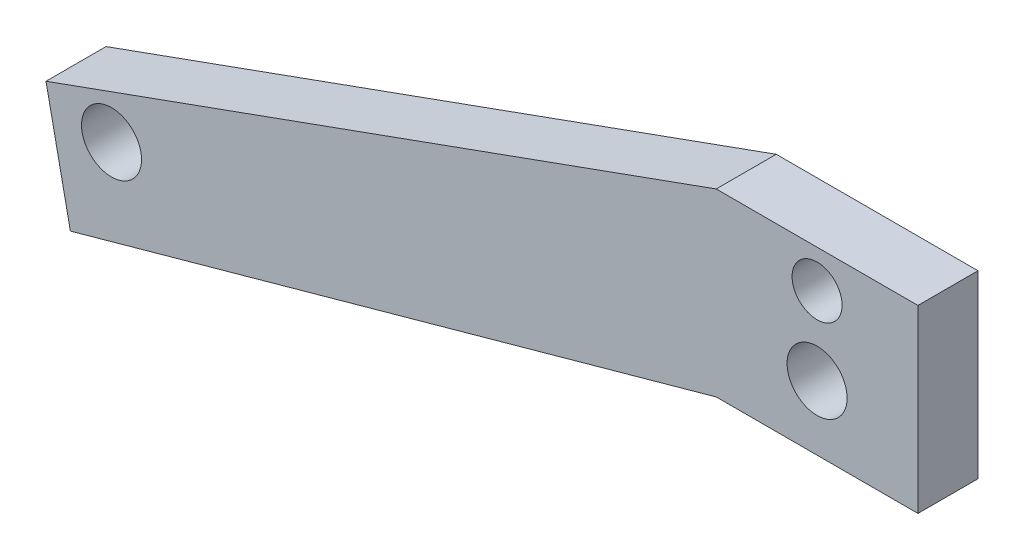
ISO-10303-21;
HEADER;
FILE_DESCRIPTION(('STEP AP214'),'2;1');
FILE_NAME('part.step','',(''),(''),'','','');
FILE_SCHEMA(('AUTOMOTIVE_DESIGN { 1 0 10303 214 1 1 1 1 }'));
ENDSEC;
DATA;
#1=APPLICATION_CONTEXT('core data for automotive mechanical design processes');
#2=APPLICATION_PROTOCOL_DEFINITION('international standard','automotive_design',2000,#1);
#3=PRODUCT_CONTEXT('',#1,'mechanical');
#4=PRODUCT('Part','Part','',(#3));
#5=PRODUCT_RELATED_PRODUCT_CATEGORY('part','',(#4));
#6=PRODUCT_DEFINITION_FORMATION('','',#4);
#7=PRODUCT_DEFINITION_CONTEXT('part definition',#1,'design');
#8=PRODUCT_DEFINITION('design','',#6,#7);
#9=PRODUCT_DEFINITION_SHAPE('','',#8);
#10=(LENGTH_UNIT() NAMED_UNIT(*) SI_UNIT(.MILLI.,.METRE.));
#11=(NAMED_UNIT(*) PLANE_ANGLE_UNIT() SI_UNIT($,.RADIAN.));
#12=(NAMED_UNIT(*) SI_UNIT($,.STERADIAN.) SOLID_ANGLE_UNIT());
#13=UNCERTAINTY_MEASURE_WITH_UNIT(LENGTH_MEASURE(1.E-05),#10,'distance_accuracy_value','');
#14=(GEOMETRIC_REPRESENTATION_CONTEXT(3) GLOBAL_UNCERTAINTY_ASSIGNED_CONTEXT((#13)) GLOBAL_UNIT_ASSIGNED_CONTEXT((#10,
#11,#12)) REPRESENTATION_CONTEXT('',''));
#15=CARTESIAN_POINT('',(0.,0.,0.));
#16=DIRECTION('',(0.,0.,1.));
#17=DIRECTION('',(1.,0.,0.));
#18=AXIS2_PLACEMENT_3D('',#15,#16,#17);
#19=CARTESIAN_POINT('',(-115.953067349948,-24.0314319640398,9.525));
#20=DIRECTION('',(-0.97919143062245,-0.202938764644804,0.));
#21=DIRECTION('',(0.202938764644804,-0.97919143062245,0.));
#22=AXIS2_PLACEMENT_3D('',#19,#20,#21);
#23=PLANE('',#22);
#24=DIRECTION('',(-0.202938764644804,0.97919143062245,0.));
#25=VECTOR('',#24,1.);
#26=CARTESIAN_POINT('',(-115.953067349948,-24.0314319640398,0.));
#27=LINE('',#26,#25);
#28=CARTESIAN_POINT('',(-118.444109854486,-12.0120059168306,0.));
#29=VERTEX_POINT('',#28);
#30=CARTESIAN_POINT('',(-122.310093320969,6.64159083652709,0.));
#31=VERTEX_POINT('',#30);
#32=EDGE_CURVE('E130',#29,#31,#27,.T.);
#33=ORIENTED_EDGE('',*,*,#32,.F.);
#34=DIRECTION('',(0.,0.,-1.));
#35=VECTOR('',#34,1.);
#36=CARTESIAN_POINT('',(-118.444109854486,-12.0120059168306,9.525));
#37=LINE('',#36,#35);
#38=CARTESIAN_POINT('',(-118.444109854486,-12.0120059168306,9.525));
#39=VERTEX_POINT('',#38);
#40=EDGE_CURVE('E11',#39,#29,#37,.T.);
#41=ORIENTED_EDGE('',*,*,#40,.F.);
#42=DIRECTION('',(-0.202938764644804,0.97919143062245,0.));
#43=VECTOR('',#42,1.);
#44=CARTESIAN_POINT('',(-115.953067349948,-24.0314319640398,9.525));
#45=LINE('',#44,#43);
#46=CARTESIAN_POINT('',(-122.310093320969,6.64159083652709,9.525));
#47=VERTEX_POINT('',#46);
#48=EDGE_CURVE('E254',#39,#47,#45,.T.);
#49=ORIENTED_EDGE('',*,*,#48,.T.);
#50=DIRECTION('',(0.,0.,-1.));
#51=VECTOR('',#50,1.);
#52=CARTESIAN_POINT('',(-122.310093320969,6.64159083652709,9.525));
#53=LINE('',#52,#51);
#54=EDGE_CURVE('E80',#47,#31,#53,.T.);
#55=ORIENTED_EDGE('',*,*,#54,.T.);
#56=EDGE_LOOP('',(#33,#41,#49,#55));
#57=FACE_BOUND('',#56,.T.);
#58=ADVANCED_FACE('F35',(#57),#23,.T.);
#59=CARTESIAN_POINT('',(-5.37781792662183,19.3735558077023,9.525));
#60=DIRECTION('',(0.267471847407683,-0.963565675418298,0.));
#61=DIRECTION('',(0.963565675418298,0.267471847407683,0.));
#62=AXIS2_PLACEMENT_3D('',#59,#60,#61);
#63=PLANE('',#62);
#64=DIRECTION('',(-0.963565675418298,-0.267471847407683,0.));
#65=VECTOR('',#64,1.);
#66=CARTESIAN_POINT('',(-5.37781792662183,19.3735558077023,0.));
#67=LINE('',#66,#65);
#68=CARTESIAN_POINT('',(-15.9999885722052,16.4249953945053,0.));
#69=VERTEX_POINT('',#68);
#70=EDGE_CURVE('E128',#69,#29,#67,.T.);
#71=ORIENTED_EDGE('',*,*,#70,.F.);
#72=DIRECTION('',(0.,0.,-1.));
#73=VECTOR('',#72,1.);
#74=CARTESIAN_POINT('',(-15.9999885722052,16.4249953945053,9.525));
#75=LINE('',#74,#73);
#76=CARTESIAN_POINT('',(-15.9999885722052,16.4249953945053,9.525));
#77=VERTEX_POINT('',#76);
#78=EDGE_CURVE('E44',#77,#69,#75,.T.);
#79=ORIENTED_EDGE('',*,*,#78,.F.);
#80=DIRECTION('',(-0.963565675418298,-0.267471847407683,0.));
#81=VECTOR('',#80,1.);
#82=CARTESIAN_POINT('',(-5.37781792662183,19.3735558077023,9.525));
#83=LINE('',#82,#81);
#84=EDGE_CURVE('E255',#77,#39,#83,.T.);
#85=ORIENTED_EDGE('',*,*,#84,.T.);
#86=ORIENTED_EDGE('',*,*,#40,.T.);
#87=EDGE_LOOP('',(#71,#79,#85,#86));
#88=FACE_BOUND('',#87,.T.);
#89=ADVANCED_FACE('F129',(#88),#63,.T.);
#90=CARTESIAN_POINT('',(0.,16.4249953945053,9.525));
#91=DIRECTION('',(0.,-1.,0.));
#92=DIRECTION('',(1.,0.,0.));
#93=AXIS2_PLACEMENT_3D('',#90,#91,#92);
#94=PLANE('',#93);
#95=DIRECTION('',(-1.,0.,0.));
#96=VECTOR('',#95,1.);
#97=CARTESIAN_POINT('',(0.,16.4249953945053,0.));
#98=LINE('',#97,#96);
#99=CARTESIAN_POINT('',(16.0000117270416,16.4249953945053,0.));
#100=VERTEX_POINT('',#99);
#101=EDGE_CURVE('E124',#100,#69,#98,.T.);
#102=ORIENTED_EDGE('',*,*,#101,.F.);
#103=DIRECTION('',(0.,0.,-1.));
#104=VECTOR('',#103,1.);
#105=CARTESIAN_POINT('',(16.0000117270416,16.4249953945053,9.525));
#106=LINE('',#105,#104);
#107=CARTESIAN_POINT('',(16.0000117270416,16.4249953945053,9.525));
#108=VERTEX_POINT('',#107);
#109=EDGE_CURVE('E114',#108,#100,#106,.T.);
#110=ORIENTED_EDGE('',*,*,#109,.F.);
#111=DIRECTION('',(-1.,0.,0.));
#112=VECTOR('',#111,1.);
#113=CARTESIAN_POINT('',(0.,16.4249953945053,9.525));
#114=LINE('',#113,#112);
#115=EDGE_CURVE('E108',#108,#77,#114,.T.);
#116=ORIENTED_EDGE('',*,*,#115,.T.);
#117=ORIENTED_EDGE('',*,*,#78,.T.);
#118=EDGE_LOOP('',(#102,#110,#116,#117));
#119=FACE_BOUND('',#118,.T.);
#120=ADVANCED_FACE('F122',(#119),#94,.T.);
#121=CARTESIAN_POINT('',(16.000011716826,-9.95134129908912E-09,9.525));
#122=DIRECTION('',(-1.,6.21958375731943E-10,0.));
#123=DIRECTION('',(-6.21958375731943E-10,-1.,0.));
#124=AXIS2_PLACEMENT_3D('',#121,#122,#123);
#125=PLANE('',#124);
#126=DIRECTION('',(6.21958375731943E-10,1.,0.));
#127=VECTOR('',#126,1.);
#128=CARTESIAN_POINT('',(16.000011716826,-9.95134129908912E-09,0.));
#129=LINE('',#128,#127);
#130=CARTESIAN_POINT('',(16.0000117448141,44.9999953945055,0.));
#131=VERTEX_POINT('',#130);
#132=EDGE_CURVE('E113',#100,#131,#129,.T.);
#133=ORIENTED_EDGE('',*,*,#132,.T.);
#134=DIRECTION('',(0.,0.,-1.));
#135=VECTOR('',#134,1.);
#136=CARTESIAN_POINT('',(16.0000117448141,44.9999953945055,9.525));
#137=LINE('',#136,#135);
#138=CARTESIAN_POINT('',(16.0000117448141,44.9999953945055,9.525));
#139=VERTEX_POINT('',#138);
#140=EDGE_CURVE('E98',#139,#131,#137,.T.);
#141=ORIENTED_EDGE('',*,*,#140,.F.);
#142=DIRECTION('',(6.21958375731943E-10,1.,0.));
#143=VECTOR('',#142,1.);
#144=CARTESIAN_POINT('',(16.000011716826,-9.95134129908912E-09,9.525));
#145=LINE('',#144,#143);
#146=EDGE_CURVE('E101',#108,#139,#145,.T.);
#147=ORIENTED_EDGE('',*,*,#146,.F.);
#148=ORIENTED_EDGE('',*,*,#109,.T.);
#149=EDGE_LOOP('',(#133,#141,#147,#148));
#150=FACE_BOUND('',#149,.T.);
#151=ADVANCED_FACE('F111',(#150),#125,.F.);
#152=CARTESIAN_POINT('',(2.66587213336432E-08,44.9999954039841,9.525));
#153=DIRECTION('',(-5.92416090142155E-10,-1.,0.));
#154=DIRECTION('',(1.,-5.92416090142156E-10,0.));
#155=AXIS2_PLACEMENT_3D('',#152,#153,#154);
#156=PLANE('',#155);
#157=DIRECTION('',(-1.,5.92416090142155E-10,0.));
#158=VECTOR('',#157,1.);
#159=CARTESIAN_POINT('',(2.66587213336432E-08,44.9999954039841,0.));
#160=LINE('',#159,#158);
#161=CARTESIAN_POINT('',(-15.999988255186,44.9999954134628,0.));
#162=VERTEX_POINT('',#161);
#163=EDGE_CURVE('E134',#131,#162,#160,.T.);
#164=ORIENTED_EDGE('',*,*,#163,.T.);
#165=DIRECTION('',(0.,0.,-1.));
#166=VECTOR('',#165,1.);
#167=CARTESIAN_POINT('',(-15.999988255186,44.9999954134628,9.525));
#168=LINE('',#167,#166);
#169=CARTESIAN_POINT('',(-15.999988255186,44.9999954134628,9.525));
#170=VERTEX_POINT('',#169);
#171=EDGE_CURVE('E100',#170,#162,#168,.T.);
#172=ORIENTED_EDGE('',*,*,#171,.F.);
#173=DIRECTION('',(-1.,5.92416090142155E-10,0.));
#174=VECTOR('',#173,1.);
#175=CARTESIAN_POINT('',(2.66587213336432E-08,44.9999954039841,9.525));
#176=LINE('',#175,#174);
#177=EDGE_CURVE('E93',#139,#170,#176,.T.);
#178=ORIENTED_EDGE('',*,*,#177,.F.);
#179=ORIENTED_EDGE('',*,*,#140,.T.);
#180=EDGE_LOOP('',(#164,#172,#178,#179));
#181=FACE_BOUND('',#180,.T.);
#182=ADVANCED_FACE('F96',(#181),#156,.F.);
#183=CARTESIAN_POINT('',(1.17412596094545E-05,38.9999954039841,9.525));
#184=DIRECTION('',(0.,0.,-1.));
#185=DIRECTION('',(-1.,0.,0.));
#186=AXIS2_PLACEMENT_3D('',#183,#184,#185);
#187=CYLINDRICAL_SURFACE('',#186,3.9687499994707);
#188=CARTESIAN_POINT('',(1.17412596094545E-05,38.9999954039841,9.525));
#189=DIRECTION('',(0.,0.,1.));
#190=DIRECTION('',(1.,0.,0.));
#191=AXIS2_PLACEMENT_3D('',#188,#189,#190);
#192=CIRCLE('',#191,3.9687499994707);
#193=CARTESIAN_POINT('',(3.96876174073031,38.9999954039841,9.525));
#194=VERTEX_POINT('',#193);
#195=EDGE_CURVE('E256',#194,#194,#192,.T.);
#196=ORIENTED_EDGE('',*,*,#195,.T.);
#197=EDGE_LOOP('',(#196));
#198=FACE_BOUND('',#197,.T.);
#199=CARTESIAN_POINT('',(1.17412596094545E-05,38.9999954039841,0.));
#200=DIRECTION('',(0.,0.,1.));
#201=DIRECTION('',(1.,0.,0.));
#202=AXIS2_PLACEMENT_3D('',#199,#200,#201);
#203=CIRCLE('',#202,3.9687499994707);
#204=CARTESIAN_POINT('',(3.96876174073031,38.9999954039841,0.));
#205=VERTEX_POINT('',#204);
#206=EDGE_CURVE('E148',#205,#205,#203,.T.);
#207=ORIENTED_EDGE('',*,*,#206,.F.);
#208=EDGE_LOOP('',(#207));
#209=FACE_BOUND('',#208,.T.);
#210=ADVANCED_FACE('F158',(#198,#209),#187,.F.);
#211=CARTESIAN_POINT('',(1.17339418303358E-05,26.6475924439837,9.525));
#212=DIRECTION('',(0.,0.,-1.));
#213=DIRECTION('',(-1.,0.,0.));
#214=AXIS2_PLACEMENT_3D('',#211,#212,#213);
#215=CYLINDRICAL_SURFACE('',#214,4.76250000164186);
#216=CARTESIAN_POINT('',(1.17339418303358E-05,26.6475924439837,9.525));
#217=DIRECTION('',(0.,0.,1.));
#218=DIRECTION('',(1.,0.,0.));
#219=AXIS2_PLACEMENT_3D('',#216,#217,#218);
#220=CIRCLE('',#219,4.76250000164186);
#221=CARTESIAN_POINT('',(4.76251173558369,26.6475924439837,9.525));
#222=VERTEX_POINT('',#221);
#223=EDGE_CURVE('E172',#222,#222,#220,.T.);
#224=ORIENTED_EDGE('',*,*,#223,.T.);
#225=EDGE_LOOP('',(#224));
#226=FACE_BOUND('',#225,.T.);
#227=CARTESIAN_POINT('',(1.17339418303358E-05,26.6475924439837,0.));
#228=DIRECTION('',(0.,0.,1.));
#229=DIRECTION('',(1.,0.,0.));
#230=AXIS2_PLACEMENT_3D('',#227,#228,#229);
#231=CIRCLE('',#230,4.76250000164186);
#232=CARTESIAN_POINT('',(4.76251173558369,26.6475924439837,0.));
#233=VERTEX_POINT('',#232);
#234=EDGE_CURVE('E145',#233,#233,#231,.T.);
#235=ORIENTED_EDGE('',*,*,#234,.F.);
#236=EDGE_LOOP('',(#235));
#237=FACE_BOUND('',#236,.T.);
#238=ADVANCED_FACE('F160',(#226,#237),#215,.F.);
#239=CARTESIAN_POINT('',(-111.921568786204,3.45169164508265,9.525));
#240=DIRECTION('',(0.,0.,-1.));
#241=DIRECTION('',(-1.,0.,0.));
#242=AXIS2_PLACEMENT_3D('',#239,#240,#241);
#243=CYLINDRICAL_SURFACE('',#242,4.76250000164186);
#244=CARTESIAN_POINT('',(-111.921568786204,3.45169164508265,9.525));
#245=DIRECTION('',(0.,0.,1.));
#246=DIRECTION('',(1.,0.,0.));
#247=AXIS2_PLACEMENT_3D('',#244,#245,#246);
#248=CIRCLE('',#247,4.76250000164186);
#249=CARTESIAN_POINT('',(-107.159068784562,3.45169164508265,9.525));
#250=VERTEX_POINT('',#249);
#251=EDGE_CURVE('E139',#250,#250,#248,.T.);
#252=ORIENTED_EDGE('',*,*,#251,.T.);
#253=EDGE_LOOP('',(#252));
#254=FACE_BOUND('',#253,.T.);
#255=CARTESIAN_POINT('',(-111.921568786204,3.45169164508265,0.));
#256=DIRECTION('',(0.,0.,1.));
#257=DIRECTION('',(1.,0.,0.));
#258=AXIS2_PLACEMENT_3D('',#255,#256,#257);
#259=CIRCLE('',#258,4.76250000164186);
#260=CARTESIAN_POINT('',(-107.159068784562,3.45169164508265,0.));
#261=VERTEX_POINT('',#260);
#262=EDGE_CURVE('E142',#261,#261,#259,.T.);
#263=ORIENTED_EDGE('',*,*,#262,.F.);
#264=EDGE_LOOP('',(#263));
#265=FACE_BOUND('',#264,.T.);
#266=ADVANCED_FACE('F37',(#254,#265),#243,.F.);
#267=CARTESIAN_POINT('',(-16.2094556369173,44.9244161957661,9.525));
#268=DIRECTION('',(0.339399019560706,-0.940642496127637,0.));
#269=DIRECTION('',(0.940642496127637,0.339399019560706,0.));
#270=AXIS2_PLACEMENT_3D('',#267,#268,#269);
#271=PLANE('',#270);
#272=DIRECTION('',(-0.940642496127637,-0.339399019560706,0.));
#273=VECTOR('',#272,1.);
#274=CARTESIAN_POINT('',(-16.2094556369173,44.9244161957661,0.));
#275=LINE('',#274,#273);
#276=EDGE_CURVE('E73',#162,#31,#275,.T.);
#277=ORIENTED_EDGE('',*,*,#276,.T.);
#278=ORIENTED_EDGE('',*,*,#54,.F.);
#279=DIRECTION('',(-0.940642496127637,-0.339399019560706,0.));
#280=VECTOR('',#279,1.);
#281=CARTESIAN_POINT('',(-16.2094556369173,44.9244161957661,9.525));
#282=LINE('',#281,#280);
#283=EDGE_CURVE('E52',#170,#47,#282,.T.);
#284=ORIENTED_EDGE('',*,*,#283,.F.);
#285=ORIENTED_EDGE('',*,*,#171,.T.);
#286=EDGE_LOOP('',(#277,#278,#284,#285));
#287=FACE_BOUND('',#286,.T.);
#288=ADVANCED_FACE('F167',(#287),#271,.F.);
#289=CARTESIAN_POINT('',(0.,0.,9.525));
#290=DIRECTION('',(0.,0.,1.));
#291=DIRECTION('',(1.,0.,0.));
#292=AXIS2_PLACEMENT_3D('',#289,#290,#291);
#293=PLANE('',#292);
#294=ORIENTED_EDGE('',*,*,#251,.F.);
#295=EDGE_LOOP('',(#294));
#296=FACE_BOUND('',#295,.T.);
#297=ORIENTED_EDGE('',*,*,#223,.F.);
#298=EDGE_LOOP('',(#297));
#299=FACE_BOUND('',#298,.T.);
#300=ORIENTED_EDGE('',*,*,#195,.F.);
#301=EDGE_LOOP('',(#300));
#302=FACE_BOUND('',#301,.T.);
#303=ORIENTED_EDGE('',*,*,#48,.F.);
#304=ORIENTED_EDGE('',*,*,#84,.F.);
#305=ORIENTED_EDGE('',*,*,#115,.F.);
#306=ORIENTED_EDGE('',*,*,#146,.T.);
#307=ORIENTED_EDGE('',*,*,#177,.T.);
#308=ORIENTED_EDGE('',*,*,#283,.T.);
#309=EDGE_LOOP('',(#303,#304,#305,#306,#307,#308));
#310=FACE_BOUND('',#309,.T.);
#311=ADVANCED_FACE('F105',(#296,#299,#302,#310),#293,.T.);
#312=CARTESIAN_POINT('',(0.,0.,0.));
#313=DIRECTION('',(0.,0.,1.));
#314=DIRECTION('',(1.,0.,0.));
#315=AXIS2_PLACEMENT_3D('',#312,#313,#314);
#316=PLANE('',#315);
#317=ORIENTED_EDGE('',*,*,#262,.T.);
#318=EDGE_LOOP('',(#317));
#319=FACE_BOUND('',#318,.T.);
#320=ORIENTED_EDGE('',*,*,#234,.T.);
#321=EDGE_LOOP('',(#320));
#322=FACE_BOUND('',#321,.T.);
#323=ORIENTED_EDGE('',*,*,#206,.T.);
#324=EDGE_LOOP('',(#323));
#325=FACE_BOUND('',#324,.T.);
#326=ORIENTED_EDGE('',*,*,#32,.T.);
#327=ORIENTED_EDGE('',*,*,#276,.F.);
#328=ORIENTED_EDGE('',*,*,#163,.F.);
#329=ORIENTED_EDGE('',*,*,#132,.F.);
#330=ORIENTED_EDGE('',*,*,#101,.T.);
#331=ORIENTED_EDGE('',*,*,#70,.T.);
#332=EDGE_LOOP('',(#326,#327,#328,#329,#330,#331));
#333=FACE_BOUND('',#332,.T.);
#334=ADVANCED_FACE('F132',(#319,#322,#325,#333),#316,.F.);
#335=CLOSED_SHELL('',(#58,#89,#120,#151,#182,#210,#238,#266,#288,#311,#334));
#336=MANIFOLD_SOLID_BREP('B2',#335);
#337=ADVANCED_BREP_SHAPE_REPRESENTATION('',(#18,#336),#14);
#338=SHAPE_DEFINITION_REPRESENTATION(#9,#337);
ENDSEC;
END-ISO-10303-21;
